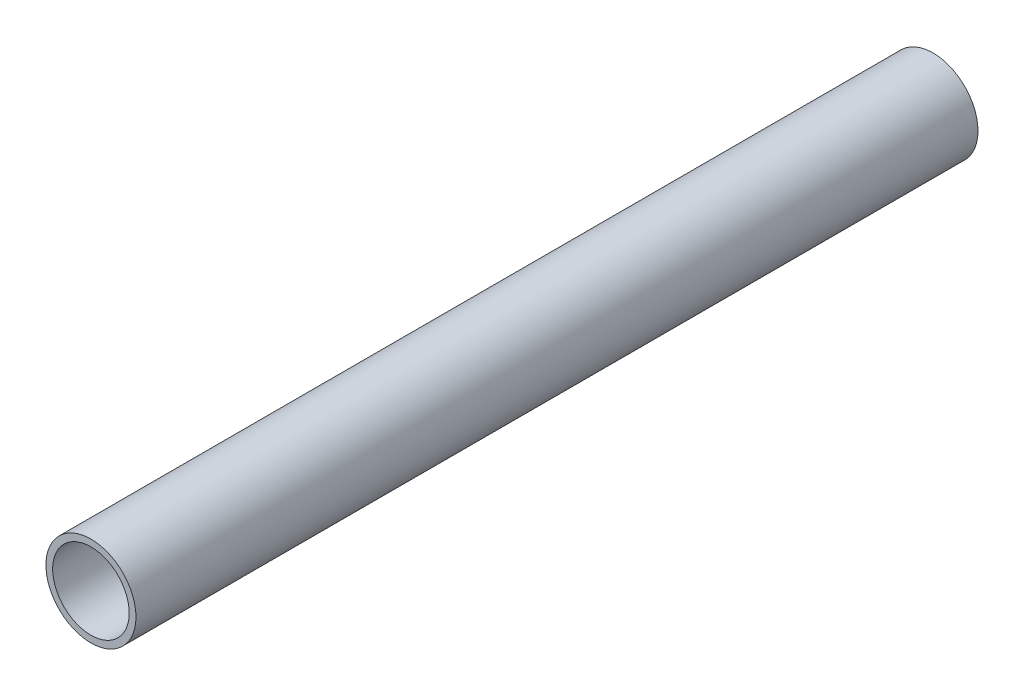
ISO-10303-21;
HEADER;
FILE_DESCRIPTION(('STEP AP214'),'2;1');
FILE_NAME('part.step','',(''),(''),'','','');
FILE_SCHEMA(('AUTOMOTIVE_DESIGN { 1 0 10303 214 1 1 1 1 }'));
ENDSEC;
DATA;
#1=APPLICATION_CONTEXT('core data for automotive mechanical design processes');
#2=APPLICATION_PROTOCOL_DEFINITION('international standard','automotive_design',2000,#1);
#3=PRODUCT_CONTEXT('',#1,'mechanical');
#4=PRODUCT('Part','Part','',(#3));
#5=PRODUCT_RELATED_PRODUCT_CATEGORY('part','',(#4));
#6=PRODUCT_DEFINITION_FORMATION('','',#4);
#7=PRODUCT_DEFINITION_CONTEXT('part definition',#1,'design');
#8=PRODUCT_DEFINITION('design','',#6,#7);
#9=PRODUCT_DEFINITION_SHAPE('','',#8);
#10=(LENGTH_UNIT() NAMED_UNIT(*) SI_UNIT(.MILLI.,.METRE.));
#11=(NAMED_UNIT(*) PLANE_ANGLE_UNIT() SI_UNIT($,.RADIAN.));
#12=(NAMED_UNIT(*) SI_UNIT($,.STERADIAN.) SOLID_ANGLE_UNIT());
#13=UNCERTAINTY_MEASURE_WITH_UNIT(LENGTH_MEASURE(1.E-05),#10,'distance_accuracy_value','');
#14=(GEOMETRIC_REPRESENTATION_CONTEXT(3) GLOBAL_UNCERTAINTY_ASSIGNED_CONTEXT((#13)) GLOBAL_UNIT_ASSIGNED_CONTEXT((#10,
#11,#12)) REPRESENTATION_CONTEXT('',''));
#15=CARTESIAN_POINT('',(0.,0.,0.));
#16=DIRECTION('',(0.,0.,1.));
#17=DIRECTION('',(1.,0.,0.));
#18=AXIS2_PLACEMENT_3D('',#15,#16,#17);
#19=CARTESIAN_POINT('',(0.,0.,237.49));
#20=DIRECTION('',(0.,0.,1.));
#21=DIRECTION('',(1.,0.,0.));
#22=AXIS2_PLACEMENT_3D('',#19,#20,#21);
#23=PLANE('',#22);
#24=CARTESIAN_POINT('',(0.,0.,237.49));
#25=DIRECTION('',(0.,0.,1.));
#26=DIRECTION('',(1.,0.,0.));
#27=AXIS2_PLACEMENT_3D('',#24,#25,#26);
#28=CIRCLE('',#27,12.7);
#29=CARTESIAN_POINT('',(12.7,0.,237.49));
#30=VERTEX_POINT('',#29);
#31=EDGE_CURVE('E10',#30,#30,#28,.T.);
#32=ORIENTED_EDGE('',*,*,#31,.T.);
#33=EDGE_LOOP('',(#32));
#34=FACE_BOUND('',#33,.T.);
#35=CARTESIAN_POINT('',(0.,0.,237.49));
#36=DIRECTION('',(0.,0.,1.));
#37=DIRECTION('',(1.,0.,0.));
#38=AXIS2_PLACEMENT_3D('',#35,#36,#37);
#39=CIRCLE('',#38,10.795);
#40=CARTESIAN_POINT('',(10.795,0.,237.49));
#41=VERTEX_POINT('',#40);
#42=EDGE_CURVE('E50',#41,#41,#39,.T.);
#43=ORIENTED_EDGE('',*,*,#42,.F.);
#44=EDGE_LOOP('',(#43));
#45=FACE_BOUND('',#44,.T.);
#46=ADVANCED_FACE('F37',(#34,#45),#23,.T.);
#47=CARTESIAN_POINT('',(0.,0.,0.));
#48=DIRECTION('',(0.,0.,1.));
#49=DIRECTION('',(1.,0.,0.));
#50=AXIS2_PLACEMENT_3D('',#47,#48,#49);
#51=PLANE('',#50);
#52=CARTESIAN_POINT('',(0.,0.,0.));
#53=DIRECTION('',(0.,0.,1.));
#54=DIRECTION('',(1.,0.,0.));
#55=AXIS2_PLACEMENT_3D('',#52,#53,#54);
#56=CIRCLE('',#55,12.7);
#57=CARTESIAN_POINT('',(12.7,0.,0.));
#58=VERTEX_POINT('',#57);
#59=EDGE_CURVE('E41',#58,#58,#56,.T.);
#60=ORIENTED_EDGE('',*,*,#59,.F.);
#61=EDGE_LOOP('',(#60));
#62=FACE_BOUND('',#61,.T.);
#63=CARTESIAN_POINT('',(0.,0.,0.));
#64=DIRECTION('',(0.,0.,1.));
#65=DIRECTION('',(1.,0.,0.));
#66=AXIS2_PLACEMENT_3D('',#63,#64,#65);
#67=CIRCLE('',#66,10.795);
#68=CARTESIAN_POINT('',(10.795,0.,0.));
#69=VERTEX_POINT('',#68);
#70=EDGE_CURVE('E52',#69,#69,#67,.T.);
#71=ORIENTED_EDGE('',*,*,#70,.T.);
#72=EDGE_LOOP('',(#71));
#73=FACE_BOUND('',#72,.T.);
#74=ADVANCED_FACE('F64',(#62,#73),#51,.F.);
#75=CARTESIAN_POINT('',(0.,0.,237.49));
#76=DIRECTION('',(0.,0.,-1.));
#77=DIRECTION('',(-1.,0.,0.));
#78=AXIS2_PLACEMENT_3D('',#75,#76,#77);
#79=CYLINDRICAL_SURFACE('',#78,12.7);
#80=ORIENTED_EDGE('',*,*,#31,.F.);
#81=EDGE_LOOP('',(#80));
#82=FACE_BOUND('',#81,.T.);
#83=ORIENTED_EDGE('',*,*,#59,.T.);
#84=EDGE_LOOP('',(#83));
#85=FACE_BOUND('',#84,.T.);
#86=ADVANCED_FACE('F39',(#82,#85),#79,.T.);
#87=CARTESIAN_POINT('',(0.,0.,237.49));
#88=DIRECTION('',(0.,0.,-1.));
#89=DIRECTION('',(-1.,0.,0.));
#90=AXIS2_PLACEMENT_3D('',#87,#88,#89);
#91=CYLINDRICAL_SURFACE('',#90,10.795);
#92=ORIENTED_EDGE('',*,*,#42,.T.);
#93=EDGE_LOOP('',(#92));
#94=FACE_BOUND('',#93,.T.);
#95=ORIENTED_EDGE('',*,*,#70,.F.);
#96=EDGE_LOOP('',(#95));
#97=FACE_BOUND('',#96,.T.);
#98=ADVANCED_FACE('F60',(#94,#97),#91,.F.);
#99=CLOSED_SHELL('',(#46,#74,#86,#98));
#100=MANIFOLD_SOLID_BREP('B2',#99);
#101=ADVANCED_BREP_SHAPE_REPRESENTATION('',(#18,#100),#14);
#102=SHAPE_DEFINITION_REPRESENTATION(#9,#101);
ENDSEC;
END-ISO-10303-21;
